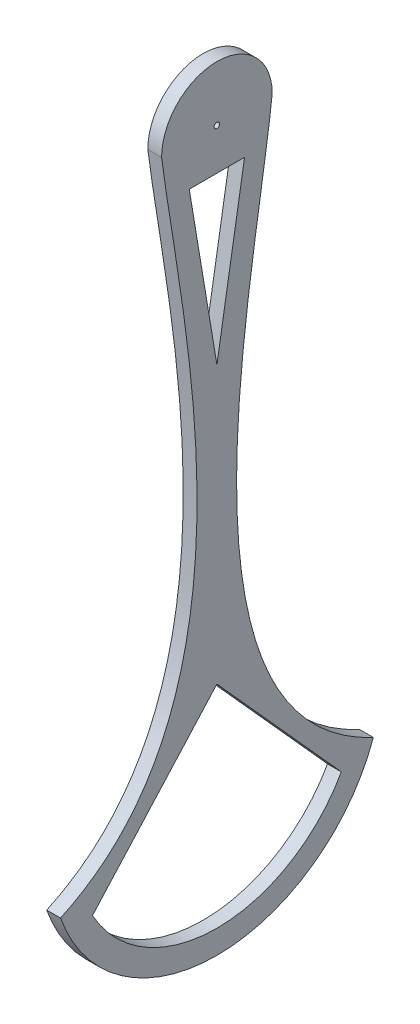
ISO-10303-21;
HEADER;
FILE_DESCRIPTION(('STEP AP214'),'2;1');
FILE_NAME('part.step','',(''),(''),'','','');
FILE_SCHEMA(('AUTOMOTIVE_DESIGN { 1 0 10303 214 1 1 1 1 }'));
ENDSEC;
DATA;
#1=APPLICATION_CONTEXT('core data for automotive mechanical design processes');
#2=APPLICATION_PROTOCOL_DEFINITION('international standard','automotive_design',2000,#1);
#3=PRODUCT_CONTEXT('',#1,'mechanical');
#4=PRODUCT('Part','Part','',(#3));
#5=PRODUCT_RELATED_PRODUCT_CATEGORY('part','',(#4));
#6=PRODUCT_DEFINITION_FORMATION('','',#4);
#7=PRODUCT_DEFINITION_CONTEXT('part definition',#1,'design');
#8=PRODUCT_DEFINITION('design','',#6,#7);
#9=PRODUCT_DEFINITION_SHAPE('','',#8);
#10=(LENGTH_UNIT() NAMED_UNIT(*) SI_UNIT(.MILLI.,.METRE.));
#11=(NAMED_UNIT(*) PLANE_ANGLE_UNIT() SI_UNIT($,.RADIAN.));
#12=(NAMED_UNIT(*) SI_UNIT($,.STERADIAN.) SOLID_ANGLE_UNIT());
#13=UNCERTAINTY_MEASURE_WITH_UNIT(LENGTH_MEASURE(1.E-05),#10,'distance_accuracy_value','');
#14=(GEOMETRIC_REPRESENTATION_CONTEXT(3) GLOBAL_UNCERTAINTY_ASSIGNED_CONTEXT((#13)) GLOBAL_UNIT_ASSIGNED_CONTEXT((#10,
#11,#12)) REPRESENTATION_CONTEXT('',''));
#15=CARTESIAN_POINT('',(0.,0.,0.));
#16=DIRECTION('',(0.,0.,1.));
#17=DIRECTION('',(1.,0.,0.));
#18=AXIS2_PLACEMENT_3D('',#15,#16,#17);
#19=CARTESIAN_POINT('',(0.,-116.603816979442,7.20200782128881));
#20=DIRECTION('',(-1.,0.,0.));
#21=DIRECTION('',(0.,0.,1.));
#22=AXIS2_PLACEMENT_3D('',#19,#20,#21);
#23=PLANE('',#22);
#24=DIRECTION('',(0.,-0.743294146247166,0.66896473162245));
#25=VECTOR('',#24,1.);
#26=CARTESIAN_POINT('',(0.,-175.,0.));
#27=LINE('',#26,#25);
#28=CARTESIAN_POINT('',(0.,-175.,0.));
#29=VERTEX_POINT('',#28);
#30=CARTESIAN_POINT('',(0.,-225.,45.));
#31=VERTEX_POINT('',#30);
#32=EDGE_CURVE('E144',#29,#31,#27,.T.);
#33=ORIENTED_EDGE('',*,*,#32,.T.);
#34=CARTESIAN_POINT('',(0.,-200.,0.));
#35=DIRECTION('',(1.,0.,0.));
#36=DIRECTION('',(0.,0.,-1.));
#37=AXIS2_PLACEMENT_3D('',#34,#35,#36);
#38=CIRCLE('',#37,51.478150704935);
#39=CARTESIAN_POINT('',(0.,-225.,-45.));
#40=VERTEX_POINT('',#39);
#41=EDGE_CURVE('E125',#31,#40,#38,.T.);
#42=ORIENTED_EDGE('',*,*,#41,.T.);
#43=DIRECTION('',(0.,0.743294146247166,0.66896473162245));
#44=VECTOR('',#43,1.);
#45=CARTESIAN_POINT('',(0.,-225.,-45.));
#46=LINE('',#45,#44);
#47=EDGE_CURVE('E152',#40,#29,#46,.T.);
#48=ORIENTED_EDGE('',*,*,#47,.T.);
#49=EDGE_LOOP('',(#33,#42,#48));
#50=FACE_BOUND('',#49,.T.);
#51=CARTESIAN_POINT('',(0.,1.46279042156018E-13,20.));
#52=CARTESIAN_POINT('',(0.,-52.728965785753,13.4618045429112));
#53=CARTESIAN_POINT('',(0.,-184.881212826092,-19.7792978511156));
#54=CARTESIAN_POINT('',(0.,-220.,56.5685424949238));
#55=B_SPLINE_CURVE_WITH_KNOTS('',3,(#51,#52,#53,#54),.UNSPECIFIED.,.F.,.F.,(4,4),(0.,1.),.UNSPECIFIED.);
#56=CARTESIAN_POINT('',(0.,0.,20.));
#57=VERTEX_POINT('',#56);
#58=CARTESIAN_POINT('',(0.,-220.,56.5685424949238));
#59=VERTEX_POINT('',#58);
#60=EDGE_CURVE('E164',#57,#59,#55,.T.);
#61=ORIENTED_EDGE('',*,*,#60,.F.);
#62=CARTESIAN_POINT('',(0.,0.,0.));
#63=DIRECTION('',(1.,0.,0.));
#64=DIRECTION('',(0.,0.,-1.));
#65=AXIS2_PLACEMENT_3D('',#62,#63,#64);
#66=CIRCLE('',#65,20.);
#67=CARTESIAN_POINT('',(0.,1.49092457919755E-13,-20.));
#68=VERTEX_POINT('',#67);
#69=EDGE_CURVE('E172',#68,#57,#66,.T.);
#70=ORIENTED_EDGE('',*,*,#69,.F.);
#71=CARTESIAN_POINT('',(0.,-220.,-56.5685424949238));
#72=CARTESIAN_POINT('',(0.,-183.938290330611,20.7660434564886));
#73=CARTESIAN_POINT('',(0.,-53.4619392663608,-14.2288435777227));
#74=CARTESIAN_POINT('',(0.,1.49092457919755E-13,-20.));
#75=B_SPLINE_CURVE_WITH_KNOTS('',3,(#71,#72,#73,#74),.UNSPECIFIED.,.F.,.F.,(4,4),(0.,1.),.UNSPECIFIED.);
#76=CARTESIAN_POINT('',(0.,-220.,-56.5685424949238));
#77=VERTEX_POINT('',#76);
#78=EDGE_CURVE('E211',#77,#68,#75,.T.);
#79=ORIENTED_EDGE('',*,*,#78,.F.);
#80=CARTESIAN_POINT('',(0.,-200.,0.));
#81=DIRECTION('',(1.,0.,0.));
#82=DIRECTION('',(0.,0.,-1.));
#83=AXIS2_PLACEMENT_3D('',#80,#81,#82);
#84=CIRCLE('',#83,60.);
#85=EDGE_CURVE('E206',#59,#77,#84,.T.);
#86=ORIENTED_EDGE('',*,*,#85,.F.);
#87=EDGE_LOOP('',(#61,#70,#79,#86));
#88=FACE_BOUND('',#87,.T.);
#89=DIRECTION('',(0.,0.,1.));
#90=VECTOR('',#89,1.);
#91=CARTESIAN_POINT('',(0.,-15.,10.));
#92=LINE('',#91,#90);
#93=CARTESIAN_POINT('',(0.,-15.,-10.));
#94=VERTEX_POINT('',#93);
#95=CARTESIAN_POINT('',(0.,-15.,10.));
#96=VERTEX_POINT('',#95);
#97=EDGE_CURVE('E119',#94,#96,#92,.T.);
#98=ORIENTED_EDGE('',*,*,#97,.T.);
#99=DIRECTION('',(0.,-0.986393923832144,-0.164398987305357));
#100=VECTOR('',#99,1.);
#101=CARTESIAN_POINT('',(0.,-15.,10.));
#102=LINE('',#101,#100);
#103=CARTESIAN_POINT('',(0.,-75.,0.));
#104=VERTEX_POINT('',#103);
#105=EDGE_CURVE('E56',#96,#104,#102,.T.);
#106=ORIENTED_EDGE('',*,*,#105,.T.);
#107=DIRECTION('',(0.,0.986393923832144,-0.164398987305357));
#108=VECTOR('',#107,1.);
#109=CARTESIAN_POINT('',(0.,-75.,0.));
#110=LINE('',#109,#108);
#111=EDGE_CURVE('E124',#104,#94,#110,.T.);
#112=ORIENTED_EDGE('',*,*,#111,.T.);
#113=EDGE_LOOP('',(#98,#106,#112));
#114=FACE_BOUND('',#113,.T.);
#115=CARTESIAN_POINT('',(0.,0.,0.));
#116=DIRECTION('',(-1.,0.,0.));
#117=DIRECTION('',(0.,0.,1.));
#118=AXIS2_PLACEMENT_3D('',#115,#116,#117);
#119=CIRCLE('',#118,10.);
#120=CARTESIAN_POINT('',(0.,0.,-9.99999999999995));
#121=VERTEX_POINT('',#120);
#122=EDGE_CURVE('E235',#121,#121,#119,.T.);
#123=ORIENTED_EDGE('',*,*,#122,.F.);
#124=EDGE_LOOP('',(#123));
#125=FACE_BOUND('',#124,.T.);
#126=ADVANCED_FACE('F33',(#50,#88,#114,#125),#23,.T.);
#127=CARTESIAN_POINT('',(5.,0.,0.));
#128=DIRECTION('',(-1.,0.,0.));
#129=DIRECTION('',(0.,0.,1.));
#130=AXIS2_PLACEMENT_3D('',#127,#128,#129);
#131=CYLINDRICAL_SURFACE('',#130,1.);
#132=CARTESIAN_POINT('',(5.,0.,0.));
#133=DIRECTION('',(1.,0.,0.));
#134=DIRECTION('',(0.,0.,-1.));
#135=AXIS2_PLACEMENT_3D('',#132,#133,#134);
#136=CIRCLE('',#135,1.);
#137=CARTESIAN_POINT('',(5.,0.,-1.));
#138=VERTEX_POINT('',#137);
#139=EDGE_CURVE('E135',#138,#138,#136,.T.);
#140=ORIENTED_EDGE('',*,*,#139,.T.);
#141=EDGE_LOOP('',(#140));
#142=FACE_BOUND('',#141,.T.);
#143=CARTESIAN_POINT('',(2.,0.,0.));
#144=DIRECTION('',(-1.,0.,0.));
#145=DIRECTION('',(0.,0.,1.));
#146=AXIS2_PLACEMENT_3D('',#143,#144,#145);
#147=CIRCLE('',#146,1.);
#148=CARTESIAN_POINT('',(2.,0.,1.));
#149=VERTEX_POINT('',#148);
#150=EDGE_CURVE('E228',#149,#149,#147,.T.);
#151=ORIENTED_EDGE('',*,*,#150,.T.);
#152=EDGE_LOOP('',(#151));
#153=FACE_BOUND('',#152,.T.);
#154=ADVANCED_FACE('F261',(#142,#153),#131,.F.);
#155=CARTESIAN_POINT('',(5.,-116.603816979442,7.20200782128881));
#156=DIRECTION('',(-1.,0.,0.));
#157=DIRECTION('',(0.,0.,1.));
#158=AXIS2_PLACEMENT_3D('',#155,#156,#157);
#159=PLANE('',#158);
#160=DIRECTION('',(0.,-0.986393923832144,-0.164398987305357));
#161=VECTOR('',#160,1.);
#162=CARTESIAN_POINT('',(5.,-15.,10.));
#163=LINE('',#162,#161);
#164=CARTESIAN_POINT('',(5.,-15.,10.));
#165=VERTEX_POINT('',#164);
#166=CARTESIAN_POINT('',(5.,-75.,0.));
#167=VERTEX_POINT('',#166);
#168=EDGE_CURVE('E110',#165,#167,#163,.T.);
#169=ORIENTED_EDGE('',*,*,#168,.F.);
#170=DIRECTION('',(0.,0.,1.));
#171=VECTOR('',#170,1.);
#172=CARTESIAN_POINT('',(5.,-15.,10.));
#173=LINE('',#172,#171);
#174=CARTESIAN_POINT('',(5.,-15.,-10.));
#175=VERTEX_POINT('',#174);
#176=EDGE_CURVE('E129',#175,#165,#173,.T.);
#177=ORIENTED_EDGE('',*,*,#176,.F.);
#178=DIRECTION('',(0.,0.986393923832144,-0.164398987305357));
#179=VECTOR('',#178,1.);
#180=CARTESIAN_POINT('',(5.,-75.,0.));
#181=LINE('',#180,#179);
#182=EDGE_CURVE('E118',#167,#175,#181,.T.);
#183=ORIENTED_EDGE('',*,*,#182,.F.);
#184=EDGE_LOOP('',(#169,#177,#183));
#185=FACE_BOUND('',#184,.T.);
#186=CARTESIAN_POINT('',(5.,1.46279042156018E-13,20.));
#187=CARTESIAN_POINT('',(5.,-52.728965785753,13.4618045429112));
#188=CARTESIAN_POINT('',(5.,-184.881212826092,-19.7792978511156));
#189=CARTESIAN_POINT('',(5.,-220.,56.5685424949238));
#190=B_SPLINE_CURVE_WITH_KNOTS('',3,(#186,#187,#188,#189),.UNSPECIFIED.,.F.,.F.,(4,4),(0.,1.),.UNSPECIFIED.);
#191=CARTESIAN_POINT('',(5.,0.,20.));
#192=VERTEX_POINT('',#191);
#193=CARTESIAN_POINT('',(5.,-220.,56.5685424949238));
#194=VERTEX_POINT('',#193);
#195=EDGE_CURVE('E165',#192,#194,#190,.T.);
#196=ORIENTED_EDGE('',*,*,#195,.T.);
#197=CARTESIAN_POINT('',(5.,-200.,0.));
#198=DIRECTION('',(1.,0.,0.));
#199=DIRECTION('',(0.,0.,-1.));
#200=AXIS2_PLACEMENT_3D('',#197,#198,#199);
#201=CIRCLE('',#200,60.);
#202=CARTESIAN_POINT('',(5.,-220.,-56.5685424949238));
#203=VERTEX_POINT('',#202);
#204=EDGE_CURVE('E171',#194,#203,#201,.T.);
#205=ORIENTED_EDGE('',*,*,#204,.T.);
#206=CARTESIAN_POINT('',(5.,-220.,-56.5685424949238));
#207=CARTESIAN_POINT('',(5.,-183.938290330611,20.7660434564886));
#208=CARTESIAN_POINT('',(5.,-53.4619392663608,-14.2288435777227));
#209=CARTESIAN_POINT('',(5.,1.49092457919755E-13,-20.));
#210=B_SPLINE_CURVE_WITH_KNOTS('',3,(#206,#207,#208,#209),.UNSPECIFIED.,.F.,.F.,(4,4),(0.,1.),.UNSPECIFIED.);
#211=CARTESIAN_POINT('',(5.,1.49092457919755E-13,-20.));
#212=VERTEX_POINT('',#211);
#213=EDGE_CURVE('E191',#203,#212,#210,.T.);
#214=ORIENTED_EDGE('',*,*,#213,.T.);
#215=CARTESIAN_POINT('',(5.,0.,0.));
#216=DIRECTION('',(1.,0.,0.));
#217=DIRECTION('',(0.,0.,-1.));
#218=AXIS2_PLACEMENT_3D('',#215,#216,#217);
#219=CIRCLE('',#218,20.);
#220=EDGE_CURVE('E196',#212,#192,#219,.T.);
#221=ORIENTED_EDGE('',*,*,#220,.T.);
#222=EDGE_LOOP('',(#196,#205,#214,#221));
#223=FACE_BOUND('',#222,.T.);
#224=CARTESIAN_POINT('',(5.,-200.,0.));
#225=DIRECTION('',(1.,0.,0.));
#226=DIRECTION('',(0.,0.,-1.));
#227=AXIS2_PLACEMENT_3D('',#224,#225,#226);
#228=CIRCLE('',#227,51.478150704935);
#229=CARTESIAN_POINT('',(5.,-225.,45.));
#230=VERTEX_POINT('',#229);
#231=CARTESIAN_POINT('',(5.,-225.,-45.));
#232=VERTEX_POINT('',#231);
#233=EDGE_CURVE('E141',#230,#232,#228,.T.);
#234=ORIENTED_EDGE('',*,*,#233,.F.);
#235=DIRECTION('',(0.,-0.743294146247166,0.66896473162245));
#236=VECTOR('',#235,1.);
#237=CARTESIAN_POINT('',(5.,-175.,0.));
#238=LINE('',#237,#236);
#239=CARTESIAN_POINT('',(5.,-175.,0.));
#240=VERTEX_POINT('',#239);
#241=EDGE_CURVE('E147',#240,#230,#238,.T.);
#242=ORIENTED_EDGE('',*,*,#241,.F.);
#243=DIRECTION('',(0.,0.743294146247166,0.66896473162245));
#244=VECTOR('',#243,1.);
#245=CARTESIAN_POINT('',(5.,-225.,-45.));
#246=LINE('',#245,#244);
#247=EDGE_CURVE('E143',#232,#240,#246,.T.);
#248=ORIENTED_EDGE('',*,*,#247,.F.);
#249=EDGE_LOOP('',(#234,#242,#248));
#250=FACE_BOUND('',#249,.T.);
#251=ORIENTED_EDGE('',*,*,#139,.F.);
#252=EDGE_LOOP('',(#251));
#253=FACE_BOUND('',#252,.T.);
#254=ADVANCED_FACE('F127',(#185,#223,#250,#253),#159,.F.);
#255=DIRECTION('',(-1.,0.,0.));
#256=VECTOR('',#255,1.);
#257=SURFACE_OF_LINEAR_EXTRUSION('',#190,#256);
#258=ORIENTED_EDGE('',*,*,#60,.T.);
#259=DIRECTION('',(-1.,0.,0.));
#260=VECTOR('',#259,1.);
#261=CARTESIAN_POINT('',(5.,-220.,56.5685424949238));
#262=LINE('',#261,#260);
#263=EDGE_CURVE('E41',#194,#59,#262,.T.);
#264=ORIENTED_EDGE('',*,*,#263,.F.);
#265=ORIENTED_EDGE('',*,*,#195,.F.);
#266=DIRECTION('',(-1.,0.,0.));
#267=VECTOR('',#266,1.);
#268=CARTESIAN_POINT('',(5.,0.,20.));
#269=LINE('',#268,#267);
#270=EDGE_CURVE('E201',#192,#57,#269,.T.);
#271=ORIENTED_EDGE('',*,*,#270,.T.);
#272=EDGE_LOOP('',(#258,#264,#265,#271));
#273=FACE_BOUND('',#272,.T.);
#274=ADVANCED_FACE('F177',(#273),#257,.F.);
#275=CARTESIAN_POINT('',(5.,-200.,0.));
#276=DIRECTION('',(-1.,0.,0.));
#277=DIRECTION('',(0.,0.,1.));
#278=AXIS2_PLACEMENT_3D('',#275,#276,#277);
#279=CYLINDRICAL_SURFACE('',#278,60.);
#280=ORIENTED_EDGE('',*,*,#85,.T.);
#281=DIRECTION('',(-1.,0.,0.));
#282=VECTOR('',#281,1.);
#283=CARTESIAN_POINT('',(5.,-220.,-56.5685424949238));
#284=LINE('',#283,#282);
#285=EDGE_CURVE('E224',#203,#77,#284,.T.);
#286=ORIENTED_EDGE('',*,*,#285,.F.);
#287=ORIENTED_EDGE('',*,*,#204,.F.);
#288=ORIENTED_EDGE('',*,*,#263,.T.);
#289=EDGE_LOOP('',(#280,#286,#287,#288));
#290=FACE_BOUND('',#289,.T.);
#291=ADVANCED_FACE('F180',(#290),#279,.T.);
#292=DIRECTION('',(-1.,0.,0.));
#293=VECTOR('',#292,1.);
#294=SURFACE_OF_LINEAR_EXTRUSION('',#210,#293);
#295=ORIENTED_EDGE('',*,*,#78,.T.);
#296=DIRECTION('',(-1.,0.,0.));
#297=VECTOR('',#296,1.);
#298=CARTESIAN_POINT('',(5.,1.49092457919755E-13,-20.));
#299=LINE('',#298,#297);
#300=EDGE_CURVE('E221',#212,#68,#299,.T.);
#301=ORIENTED_EDGE('',*,*,#300,.F.);
#302=ORIENTED_EDGE('',*,*,#213,.F.);
#303=ORIENTED_EDGE('',*,*,#285,.T.);
#304=EDGE_LOOP('',(#295,#301,#302,#303));
#305=FACE_BOUND('',#304,.T.);
#306=ADVANCED_FACE('F184',(#305),#294,.F.);
#307=CARTESIAN_POINT('',(5.,0.,0.));
#308=DIRECTION('',(-1.,0.,0.));
#309=DIRECTION('',(0.,0.,1.));
#310=AXIS2_PLACEMENT_3D('',#307,#308,#309);
#311=CYLINDRICAL_SURFACE('',#310,20.);
#312=ORIENTED_EDGE('',*,*,#69,.T.);
#313=ORIENTED_EDGE('',*,*,#270,.F.);
#314=ORIENTED_EDGE('',*,*,#220,.F.);
#315=ORIENTED_EDGE('',*,*,#300,.T.);
#316=EDGE_LOOP('',(#312,#313,#314,#315));
#317=FACE_BOUND('',#316,.T.);
#318=ADVANCED_FACE('F188',(#317),#311,.T.);
#319=CARTESIAN_POINT('',(5.,-200.,0.));
#320=DIRECTION('',(-1.,0.,0.));
#321=DIRECTION('',(0.,0.,1.));
#322=AXIS2_PLACEMENT_3D('',#319,#320,#321);
#323=CYLINDRICAL_SURFACE('',#322,51.478150704935);
#324=ORIENTED_EDGE('',*,*,#41,.F.);
#325=DIRECTION('',(-1.,0.,0.));
#326=VECTOR('',#325,1.);
#327=CARTESIAN_POINT('',(5.,-225.,45.));
#328=LINE('',#327,#326);
#329=EDGE_CURVE('E149',#230,#31,#328,.T.);
#330=ORIENTED_EDGE('',*,*,#329,.F.);
#331=ORIENTED_EDGE('',*,*,#233,.T.);
#332=DIRECTION('',(-1.,0.,0.));
#333=VECTOR('',#332,1.);
#334=CARTESIAN_POINT('',(5.,-225.,-45.));
#335=LINE('',#334,#333);
#336=EDGE_CURVE('E161',#232,#40,#335,.T.);
#337=ORIENTED_EDGE('',*,*,#336,.T.);
#338=EDGE_LOOP('',(#324,#330,#331,#337));
#339=FACE_BOUND('',#338,.T.);
#340=ADVANCED_FACE('F272',(#339),#323,.F.);
#341=CARTESIAN_POINT('',(5.,-225.,-45.));
#342=DIRECTION('',(0.,-0.66896473162245,0.743294146247166));
#343=DIRECTION('',(0.,-0.743294146247166,-0.66896473162245));
#344=AXIS2_PLACEMENT_3D('',#341,#342,#343);
#345=PLANE('',#344);
#346=ORIENTED_EDGE('',*,*,#47,.F.);
#347=ORIENTED_EDGE('',*,*,#336,.F.);
#348=ORIENTED_EDGE('',*,*,#247,.T.);
#349=DIRECTION('',(-1.,0.,0.));
#350=VECTOR('',#349,1.);
#351=CARTESIAN_POINT('',(5.,-175.,0.));
#352=LINE('',#351,#350);
#353=EDGE_CURVE('E159',#240,#29,#352,.T.);
#354=ORIENTED_EDGE('',*,*,#353,.T.);
#355=EDGE_LOOP('',(#346,#347,#348,#354));
#356=FACE_BOUND('',#355,.T.);
#357=ADVANCED_FACE('F275',(#356),#345,.T.);
#358=CARTESIAN_POINT('',(5.,-175.,0.));
#359=DIRECTION('',(0.,-0.66896473162245,-0.743294146247166));
#360=DIRECTION('',(0.,0.743294146247166,-0.66896473162245));
#361=AXIS2_PLACEMENT_3D('',#358,#359,#360);
#362=PLANE('',#361);
#363=ORIENTED_EDGE('',*,*,#32,.F.);
#364=ORIENTED_EDGE('',*,*,#353,.F.);
#365=ORIENTED_EDGE('',*,*,#241,.T.);
#366=ORIENTED_EDGE('',*,*,#329,.T.);
#367=EDGE_LOOP('',(#363,#364,#365,#366));
#368=FACE_BOUND('',#367,.T.);
#369=ADVANCED_FACE('F279',(#368),#362,.T.);
#370=CARTESIAN_POINT('',(5.,-15.,10.));
#371=DIRECTION('',(0.,0.164398987305357,-0.986393923832144));
#372=DIRECTION('',(0.,0.986393923832144,0.164398987305357));
#373=AXIS2_PLACEMENT_3D('',#370,#371,#372);
#374=PLANE('',#373);
#375=ORIENTED_EDGE('',*,*,#105,.F.);
#376=DIRECTION('',(-1.,0.,0.));
#377=VECTOR('',#376,1.);
#378=CARTESIAN_POINT('',(5.,-15.,10.));
#379=LINE('',#378,#377);
#380=EDGE_CURVE('E114',#165,#96,#379,.T.);
#381=ORIENTED_EDGE('',*,*,#380,.F.);
#382=ORIENTED_EDGE('',*,*,#168,.T.);
#383=DIRECTION('',(-1.,0.,0.));
#384=VECTOR('',#383,1.);
#385=CARTESIAN_POINT('',(5.,-75.,0.));
#386=LINE('',#385,#384);
#387=EDGE_CURVE('E113',#167,#104,#386,.T.);
#388=ORIENTED_EDGE('',*,*,#387,.T.);
#389=EDGE_LOOP('',(#375,#381,#382,#388));
#390=FACE_BOUND('',#389,.T.);
#391=ADVANCED_FACE('F112',(#390),#374,.T.);
#392=CARTESIAN_POINT('',(5.,-75.,0.));
#393=DIRECTION('',(0.,0.164398987305357,0.986393923832144));
#394=DIRECTION('',(0.,-0.986393923832144,0.164398987305357));
#395=AXIS2_PLACEMENT_3D('',#392,#393,#394);
#396=PLANE('',#395);
#397=ORIENTED_EDGE('',*,*,#111,.F.);
#398=ORIENTED_EDGE('',*,*,#387,.F.);
#399=ORIENTED_EDGE('',*,*,#182,.T.);
#400=DIRECTION('',(-1.,0.,0.));
#401=VECTOR('',#400,1.);
#402=CARTESIAN_POINT('',(5.,-15.,-10.));
#403=LINE('',#402,#401);
#404=EDGE_CURVE('E48',#175,#94,#403,.T.);
#405=ORIENTED_EDGE('',*,*,#404,.T.);
#406=EDGE_LOOP('',(#397,#398,#399,#405));
#407=FACE_BOUND('',#406,.T.);
#408=ADVANCED_FACE('F122',(#407),#396,.T.);
#409=CARTESIAN_POINT('',(5.,-15.,10.));
#410=DIRECTION('',(0.,-1.,0.));
#411=DIRECTION('',(0.,0.,-1.));
#412=AXIS2_PLACEMENT_3D('',#409,#410,#411);
#413=PLANE('',#412);
#414=ORIENTED_EDGE('',*,*,#97,.F.);
#415=ORIENTED_EDGE('',*,*,#404,.F.);
#416=ORIENTED_EDGE('',*,*,#176,.T.);
#417=ORIENTED_EDGE('',*,*,#380,.T.);
#418=EDGE_LOOP('',(#414,#415,#416,#417));
#419=FACE_BOUND('',#418,.T.);
#420=ADVANCED_FACE('F288',(#419),#413,.T.);
#421=CARTESIAN_POINT('',(2.,0.,0.));
#422=DIRECTION('',(-1.,0.,0.));
#423=DIRECTION('',(0.,0.,1.));
#424=AXIS2_PLACEMENT_3D('',#421,#422,#423);
#425=CYLINDRICAL_SURFACE('',#424,3.);
#426=CARTESIAN_POINT('',(2.,0.,0.));
#427=DIRECTION('',(-1.,0.,0.));
#428=DIRECTION('',(0.,0.,1.));
#429=AXIS2_PLACEMENT_3D('',#426,#427,#428);
#430=CIRCLE('',#429,3.);
#431=CARTESIAN_POINT('',(2.,0.,3.));
#432=VERTEX_POINT('',#431);
#433=EDGE_CURVE('E230',#432,#432,#430,.T.);
#434=ORIENTED_EDGE('',*,*,#433,.F.);
#435=EDGE_LOOP('',(#434));
#436=FACE_BOUND('',#435,.T.);
#437=CARTESIAN_POINT('',(-3.,0.,0.));
#438=DIRECTION('',(-1.,0.,0.));
#439=DIRECTION('',(0.,0.,1.));
#440=AXIS2_PLACEMENT_3D('',#437,#438,#439);
#441=CIRCLE('',#440,3.);
#442=CARTESIAN_POINT('',(-3.,0.,3.));
#443=VERTEX_POINT('',#442);
#444=EDGE_CURVE('E240',#443,#443,#441,.T.);
#445=ORIENTED_EDGE('',*,*,#444,.T.);
#446=EDGE_LOOP('',(#445));
#447=FACE_BOUND('',#446,.T.);
#448=ADVANCED_FACE('F246',(#436,#447),#425,.F.);
#449=CARTESIAN_POINT('',(2.,0.,0.));
#450=DIRECTION('',(-1.,0.,0.));
#451=DIRECTION('',(0.,0.,1.));
#452=AXIS2_PLACEMENT_3D('',#449,#450,#451);
#453=PLANE('',#452);
#454=ORIENTED_EDGE('',*,*,#150,.F.);
#455=EDGE_LOOP('',(#454));
#456=FACE_BOUND('',#455,.T.);
#457=ORIENTED_EDGE('',*,*,#433,.T.);
#458=EDGE_LOOP('',(#457));
#459=FACE_BOUND('',#458,.T.);
#460=ADVANCED_FACE('F250',(#456,#459),#453,.T.);
#461=CARTESIAN_POINT('',(-3.,0.,0.));
#462=DIRECTION('',(-1.,0.,0.));
#463=DIRECTION('',(0.,0.,1.));
#464=AXIS2_PLACEMENT_3D('',#461,#462,#463);
#465=PLANE('',#464);
#466=CARTESIAN_POINT('',(-3.,0.,0.));
#467=DIRECTION('',(-1.,0.,0.));
#468=DIRECTION('',(0.,0.,1.));
#469=AXIS2_PLACEMENT_3D('',#466,#467,#468);
#470=CIRCLE('',#469,6.99999999999995);
#471=CARTESIAN_POINT('',(-3.,0.,-6.99999999999995));
#472=VERTEX_POINT('',#471);
#473=EDGE_CURVE('E11',#472,#472,#470,.T.);
#474=ORIENTED_EDGE('',*,*,#473,.T.);
#475=EDGE_LOOP('',(#474));
#476=FACE_BOUND('',#475,.T.);
#477=ORIENTED_EDGE('',*,*,#444,.F.);
#478=EDGE_LOOP('',(#477));
#479=FACE_BOUND('',#478,.T.);
#480=ADVANCED_FACE('F248',(#476,#479),#465,.T.);
#481=CARTESIAN_POINT('',(-3.,0.,0.));
#482=DIRECTION('',(1.,0.,0.));
#483=DIRECTION('',(0.,0.,-1.));
#484=AXIS2_PLACEMENT_3D('',#481,#482,#483);
#485=CONICAL_SURFACE('',#484,6.99999999999995,0.785398163397447);
#486=CARTESIAN_POINT('',(0.,0.,-9.99999999999995));
#487=CARTESIAN_POINT('',(-0.0312499999999997,0.,-9.96874999999995));
#488=CARTESIAN_POINT('',(-0.0624999999999996,0.,-9.93749999999995));
#489=CARTESIAN_POINT('',(-0.125,0.,-9.87499999999995));
#490=CARTESIAN_POINT('',(-0.15625,0.,-9.84374999999995));
#491=CARTESIAN_POINT('',(-0.21875,0.,-9.78124999999995));
#492=CARTESIAN_POINT('',(-0.25,0.,-9.74999999999995));
#493=CARTESIAN_POINT('',(-0.3125,0.,-9.68749999999995));
#494=CARTESIAN_POINT('',(-0.343749999999999,0.,-9.65624999999995));
#495=CARTESIAN_POINT('',(-0.406249999999999,0.,-9.59374999999995));
#496=CARTESIAN_POINT('',(-0.4375,0.,-9.56249999999995));
#497=CARTESIAN_POINT('',(-0.5,0.,-9.49999999999995));
#498=CARTESIAN_POINT('',(-0.53125,0.,-9.46874999999995));
#499=CARTESIAN_POINT('',(-0.59375,0.,-9.40624999999995));
#500=CARTESIAN_POINT('',(-0.625,0.,-9.37499999999995));
#501=CARTESIAN_POINT('',(-0.6875,0.,-9.31249999999995));
#502=CARTESIAN_POINT('',(-0.71875,0.,-9.28124999999995));
#503=CARTESIAN_POINT('',(-0.78125,0.,-9.21874999999995));
#504=CARTESIAN_POINT('',(-0.812499999999999,0.,-9.18749999999995));
#505=CARTESIAN_POINT('',(-0.874999999999999,0.,-9.12499999999995));
#506=CARTESIAN_POINT('',(-0.90625,0.,-9.09374999999995));
#507=CARTESIAN_POINT('',(-0.96875,0.,-9.03124999999995));
#508=CARTESIAN_POINT('',(-1.,0.,-8.99999999999995));
#509=CARTESIAN_POINT('',(-1.0625,0.,-8.93749999999995));
#510=CARTESIAN_POINT('',(-1.09375,0.,-8.90624999999995));
#511=CARTESIAN_POINT('',(-1.15625,0.,-8.84374999999995));
#512=CARTESIAN_POINT('',(-1.1875,0.,-8.81249999999995));
#513=CARTESIAN_POINT('',(-1.25,0.,-8.74999999999995));
#514=CARTESIAN_POINT('',(-1.28125,0.,-8.71874999999995));
#515=CARTESIAN_POINT('',(-1.34375,0.,-8.65624999999995));
#516=CARTESIAN_POINT('',(-1.375,0.,-8.62499999999995));
#517=CARTESIAN_POINT('',(-1.4375,0.,-8.56249999999995));
#518=CARTESIAN_POINT('',(-1.46875,0.,-8.53124999999995));
#519=CARTESIAN_POINT('',(-1.53125,0.,-8.46874999999995));
#520=CARTESIAN_POINT('',(-1.5625,0.,-8.43749999999995));
#521=CARTESIAN_POINT('',(-1.625,0.,-8.37499999999995));
#522=CARTESIAN_POINT('',(-1.65625,0.,-8.34374999999995));
#523=CARTESIAN_POINT('',(-1.71875,0.,-8.28124999999995));
#524=CARTESIAN_POINT('',(-1.75,0.,-8.24999999999995));
#525=CARTESIAN_POINT('',(-1.8125,0.,-8.18749999999995));
#526=CARTESIAN_POINT('',(-1.84375,0.,-8.15624999999995));
#527=CARTESIAN_POINT('',(-1.90625,0.,-8.09374999999995));
#528=CARTESIAN_POINT('',(-1.9375,0.,-8.06249999999995));
#529=CARTESIAN_POINT('',(-2.,0.,-7.99999999999995));
#530=CARTESIAN_POINT('',(-2.03125,0.,-7.96874999999995));
#531=CARTESIAN_POINT('',(-2.09375,0.,-7.90624999999995));
#532=CARTESIAN_POINT('',(-2.125,0.,-7.87499999999995));
#533=CARTESIAN_POINT('',(-2.1875,0.,-7.81249999999995));
#534=CARTESIAN_POINT('',(-2.21875,0.,-7.78124999999995));
#535=CARTESIAN_POINT('',(-2.28125,0.,-7.71874999999995));
#536=CARTESIAN_POINT('',(-2.3125,0.,-7.68749999999995));
#537=CARTESIAN_POINT('',(-2.375,0.,-7.62499999999995));
#538=CARTESIAN_POINT('',(-2.40625,0.,-7.59374999999995));
#539=CARTESIAN_POINT('',(-2.46875,0.,-7.53124999999995));
#540=CARTESIAN_POINT('',(-2.5,0.,-7.49999999999995));
#541=CARTESIAN_POINT('',(-2.5625,0.,-7.43749999999995));
#542=CARTESIAN_POINT('',(-2.59375,0.,-7.40624999999995));
#543=CARTESIAN_POINT('',(-2.65625,0.,-7.34374999999995));
#544=CARTESIAN_POINT('',(-2.6875,0.,-7.31249999999995));
#545=CARTESIAN_POINT('',(-2.75,0.,-7.24999999999995));
#546=CARTESIAN_POINT('',(-2.78125,0.,-7.21874999999995));
#547=CARTESIAN_POINT('',(-2.84375,0.,-7.15624999999995));
#548=CARTESIAN_POINT('',(-2.875,0.,-7.12499999999995));
#549=CARTESIAN_POINT('',(-2.9375,0.,-7.06249999999995));
#550=CARTESIAN_POINT('',(-2.96875,0.,-7.03124999999995));
#551=CARTESIAN_POINT('',(-3.,0.,-6.99999999999995));
#552=B_SPLINE_CURVE_WITH_KNOTS('',3,(#486,#487,#488,#489,#490,#491,#492,#493,#494,#495,#496,
#497,#498,#499,#500,#501,#502,#503,#504,#505,#506,#507,#508,#509,#510,#511,#512,#513,#514,#515,
#516,#517,#518,#519,#520,#521,#522,#523,#524,#525,#526,#527,#528,#529,#530,#531,#532,#533,#534,
#535,#536,#537,#538,#539,#540,#541,#542,#543,#544,#545,#546,#547,#548,#549,#550,#551),
.UNSPECIFIED.,.F.,.F.,(4,2,2,2,2,2,2,2,2,2,2,2,2,2,2,2,2,2,2,2,2,2,2,2,2,2,2,2,2,2,2,2,4),(0.,
0.132582521472478,0.265165042944956,0.397747564417433,0.530330085889911,0.662912607362387,
0.795495128834865,0.928077650307343,1.06066017177982,1.1932426932523,1.32582521472477,
1.45840773619725,1.59099025766973,1.72357277914221,1.85615530061469,1.98873782208716,
2.12132034355964,2.25390286503212,2.3864853865046,2.51906790797707,2.65165042944955,
2.78423295092203,2.91681547239451,3.04939799386698,3.18198051533946,3.31456303681194,
3.44714555828442,3.57972807975689,3.71231060122937,3.84489312270185,3.97747564417433,
4.1100581656468,4.24264068711928),.UNSPECIFIED.);
#553=EDGE_CURVE('BSEAM35',#121,#472,#552,.T.);
#554=ORIENTED_EDGE('',*,*,#122,.T.);
#555=ORIENTED_EDGE('',*,*,#473,.F.);
#556=ORIENTED_EDGE('',*,*,#553,.T.);
#557=ORIENTED_EDGE('',*,*,#553,.F.);
#558=EDGE_LOOP('',(#554,#556,#555,#557));
#559=FACE_BOUND('',#558,.T.);
#560=ADVANCED_FACE('F35',(#559),#485,.T.);
#561=CLOSED_SHELL('',(#126,#154,#254,#274,#291,#306,#318,#340,#357,#369,#391,#408,#420,#448,
#460,#480,#560));
#562=MANIFOLD_SOLID_BREP('B2',#561);
#563=ADVANCED_BREP_SHAPE_REPRESENTATION('',(#18,#562),#14);
#564=SHAPE_DEFINITION_REPRESENTATION(#9,#563);
ENDSEC;
END-ISO-10303-21;
